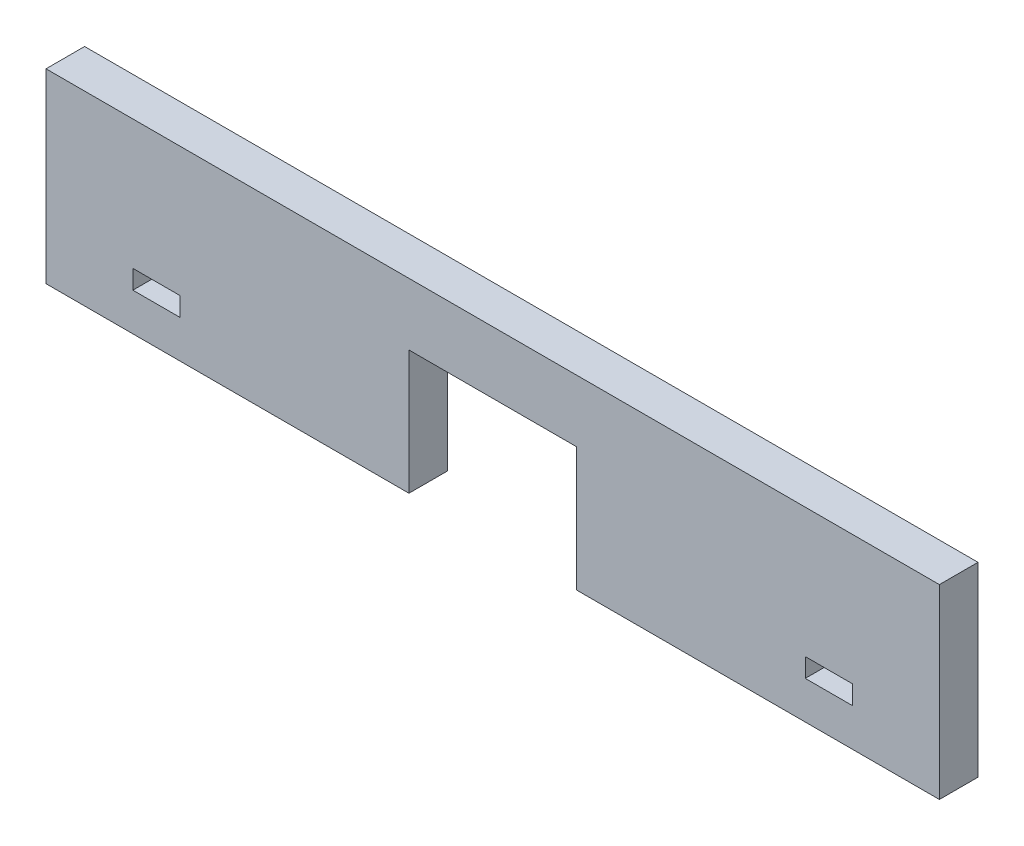
ISO-10303-21;
HEADER;
FILE_DESCRIPTION(('STEP AP214'),'2;1');
FILE_NAME('part.step','',(''),(''),'','','');
FILE_SCHEMA(('AUTOMOTIVE_DESIGN { 1 0 10303 214 1 1 1 1 }'));
ENDSEC;
DATA;
#1=APPLICATION_CONTEXT('core data for automotive mechanical design processes');
#2=APPLICATION_PROTOCOL_DEFINITION('international standard','automotive_design',2000,#1);
#3=PRODUCT_CONTEXT('',#1,'mechanical');
#4=PRODUCT('Part','Part','',(#3));
#5=PRODUCT_RELATED_PRODUCT_CATEGORY('part','',(#4));
#6=PRODUCT_DEFINITION_FORMATION('','',#4);
#7=PRODUCT_DEFINITION_CONTEXT('part definition',#1,'design');
#8=PRODUCT_DEFINITION('design','',#6,#7);
#9=PRODUCT_DEFINITION_SHAPE('','',#8);
#10=(LENGTH_UNIT() NAMED_UNIT(*) SI_UNIT(.MILLI.,.METRE.));
#11=(NAMED_UNIT(*) PLANE_ANGLE_UNIT() SI_UNIT($,.RADIAN.));
#12=(NAMED_UNIT(*) SI_UNIT($,.STERADIAN.) SOLID_ANGLE_UNIT());
#13=UNCERTAINTY_MEASURE_WITH_UNIT(LENGTH_MEASURE(1.E-05),#10,'distance_accuracy_value','');
#14=(GEOMETRIC_REPRESENTATION_CONTEXT(3) GLOBAL_UNCERTAINTY_ASSIGNED_CONTEXT((#13)) GLOBAL_UNIT_ASSIGNED_CONTEXT((#10,
#11,#12)) REPRESENTATION_CONTEXT('',''));
#15=CARTESIAN_POINT('',(0.,0.,0.));
#16=DIRECTION('',(0.,0.,1.));
#17=DIRECTION('',(1.,0.,0.));
#18=AXIS2_PLACEMENT_3D('',#15,#16,#17);
#19=CARTESIAN_POINT('',(0.,0.,3.1115));
#20=DIRECTION('',(0.,0.,-1.));
#21=DIRECTION('',(-1.,0.,0.));
#22=AXIS2_PLACEMENT_3D('',#19,#20,#21);
#23=PLANE('',#22);
#24=DIRECTION('',(0.,1.,0.));
#25=VECTOR('',#24,1.);
#26=CARTESIAN_POINT('',(-25.2074197182899,-4.5434357073753,3.1115));
#27=LINE('',#26,#25);
#28=CARTESIAN_POINT('',(-25.2074197182899,-4.5434357073753,3.1115));
#29=VERTEX_POINT('',#28);
#30=CARTESIAN_POINT('',(-25.2074197182899,-3.01943570737531,3.1115));
#31=VERTEX_POINT('',#30);
#32=EDGE_CURVE('E182',#29,#31,#27,.T.);
#33=ORIENTED_EDGE('',*,*,#32,.F.);
#34=DIRECTION('',(1.,0.,0.));
#35=VECTOR('',#34,1.);
#36=CARTESIAN_POINT('',(-29.0174197182899,-4.5434357073753,3.1115));
#37=LINE('',#36,#35);
#38=CARTESIAN_POINT('',(-29.0174197182899,-4.5434357073753,3.1115));
#39=VERTEX_POINT('',#38);
#40=EDGE_CURVE('E190',#39,#29,#37,.T.);
#41=ORIENTED_EDGE('',*,*,#40,.F.);
#42=DIRECTION('',(0.,-1.,0.));
#43=VECTOR('',#42,1.);
#44=CARTESIAN_POINT('',(-29.0174197182899,-4.5434357073753,3.1115));
#45=LINE('',#44,#43);
#46=CARTESIAN_POINT('',(-29.0174197182899,-3.01943570737531,3.1115));
#47=VERTEX_POINT('',#46);
#48=EDGE_CURVE('E187',#47,#39,#45,.T.);
#49=ORIENTED_EDGE('',*,*,#48,.F.);
#50=DIRECTION('',(-1.,0.,0.));
#51=VECTOR('',#50,1.);
#52=CARTESIAN_POINT('',(-29.0174197182899,-3.01943570737531,3.1115));
#53=LINE('',#52,#51);
#54=EDGE_CURVE('E184',#31,#47,#53,.T.);
#55=ORIENTED_EDGE('',*,*,#54,.F.);
#56=EDGE_LOOP('',(#33,#41,#49,#55));
#57=FACE_BOUND('',#56,.T.);
#58=DIRECTION('',(0.,1.,0.));
#59=VECTOR('',#58,1.);
#60=CARTESIAN_POINT('',(35.9825802817101,4.9085642926247,3.1115));
#61=LINE('',#60,#59);
#62=CARTESIAN_POINT('',(35.9825802817101,-7.5914357073753,3.1115));
#63=VERTEX_POINT('',#62);
#64=CARTESIAN_POINT('',(35.9825802817101,7.40856429262469,3.1115));
#65=VERTEX_POINT('',#64);
#66=EDGE_CURVE('E213',#63,#65,#61,.T.);
#67=ORIENTED_EDGE('',*,*,#66,.T.);
#68=DIRECTION('',(-1.,0.,0.));
#69=VECTOR('',#68,1.);
#70=CARTESIAN_POINT('',(-36.0174197182899,7.40856429262469,3.1115));
#71=LINE('',#70,#69);
#72=CARTESIAN_POINT('',(-36.0174197182899,7.40856429262469,3.1115));
#73=VERTEX_POINT('',#72);
#74=EDGE_CURVE('E216',#65,#73,#71,.T.);
#75=ORIENTED_EDGE('',*,*,#74,.T.);
#76=DIRECTION('',(0.,-1.,0.));
#77=VECTOR('',#76,1.);
#78=CARTESIAN_POINT('',(-36.0174197182899,4.9085642926247,3.1115));
#79=LINE('',#78,#77);
#80=CARTESIAN_POINT('',(-36.0174197182899,-7.5914357073753,3.1115));
#81=VERTEX_POINT('',#80);
#82=EDGE_CURVE('E219',#73,#81,#79,.T.);
#83=ORIENTED_EDGE('',*,*,#82,.T.);
#84=DIRECTION('',(1.,0.,0.));
#85=VECTOR('',#84,1.);
#86=CARTESIAN_POINT('',(-36.0174197182899,-7.5914357073753,3.1115));
#87=LINE('',#86,#85);
#88=CARTESIAN_POINT('',(-6.7674197182899,-7.5914357073753,3.1115));
#89=VERTEX_POINT('',#88);
#90=EDGE_CURVE('E221',#81,#89,#87,.T.);
#91=ORIENTED_EDGE('',*,*,#90,.T.);
#92=DIRECTION('',(0.,1.,0.));
#93=VECTOR('',#92,1.);
#94=CARTESIAN_POINT('',(-6.7674197182899,2.4085642926247,3.1115));
#95=LINE('',#94,#93);
#96=CARTESIAN_POINT('',(-6.7674197182899,2.4085642926247,3.1115));
#97=VERTEX_POINT('',#96);
#98=EDGE_CURVE('E223',#89,#97,#95,.T.);
#99=ORIENTED_EDGE('',*,*,#98,.T.);
#100=DIRECTION('',(1.,0.,0.));
#101=VECTOR('',#100,1.);
#102=CARTESIAN_POINT('',(-6.7674197182899,2.4085642926247,3.1115));
#103=LINE('',#102,#101);
#104=CARTESIAN_POINT('',(6.73258028171012,2.4085642926247,3.1115));
#105=VERTEX_POINT('',#104);
#106=EDGE_CURVE('E225',#97,#105,#103,.T.);
#107=ORIENTED_EDGE('',*,*,#106,.T.);
#108=DIRECTION('',(0.,-1.,0.));
#109=VECTOR('',#108,1.);
#110=CARTESIAN_POINT('',(6.73258028171012,2.4085642926247,3.1115));
#111=LINE('',#110,#109);
#112=CARTESIAN_POINT('',(6.73258028171012,-7.5914357073753,3.1115));
#113=VERTEX_POINT('',#112);
#114=EDGE_CURVE('E227',#105,#113,#111,.T.);
#115=ORIENTED_EDGE('',*,*,#114,.T.);
#116=DIRECTION('',(1.,0.,0.));
#117=VECTOR('',#116,1.);
#118=CARTESIAN_POINT('',(6.73258028171012,-7.5914357073753,3.1115));
#119=LINE('',#118,#117);
#120=EDGE_CURVE('E229',#113,#63,#119,.T.);
#121=ORIENTED_EDGE('',*,*,#120,.T.);
#122=EDGE_LOOP('',(#67,#75,#83,#91,#99,#107,#115,#121));
#123=FACE_BOUND('',#122,.T.);
#124=DIRECTION('',(1.,0.,0.));
#125=VECTOR('',#124,1.);
#126=CARTESIAN_POINT('',(28.9825802817101,-4.5434357073753,3.1115));
#127=LINE('',#126,#125);
#128=CARTESIAN_POINT('',(25.1725802817101,-4.5434357073753,3.1115));
#129=VERTEX_POINT('',#128);
#130=CARTESIAN_POINT('',(28.9825802817101,-4.5434357073753,3.1115));
#131=VERTEX_POINT('',#130);
#132=EDGE_CURVE('E146',#129,#131,#127,.T.);
#133=ORIENTED_EDGE('',*,*,#132,.F.);
#134=DIRECTION('',(0.,-1.,0.));
#135=VECTOR('',#134,1.);
#136=CARTESIAN_POINT('',(25.1725802817101,-4.5434357073753,3.1115));
#137=LINE('',#136,#135);
#138=CARTESIAN_POINT('',(25.1725802817101,-3.01943570737531,3.1115));
#139=VERTEX_POINT('',#138);
#140=EDGE_CURVE('E168',#139,#129,#137,.T.);
#141=ORIENTED_EDGE('',*,*,#140,.F.);
#142=DIRECTION('',(-1.,0.,0.));
#143=VECTOR('',#142,1.);
#144=CARTESIAN_POINT('',(28.9825802817101,-3.01943570737531,3.1115));
#145=LINE('',#144,#143);
#146=CARTESIAN_POINT('',(28.9825802817101,-3.01943570737531,3.1115));
#147=VERTEX_POINT('',#146);
#148=EDGE_CURVE('E166',#147,#139,#145,.T.);
#149=ORIENTED_EDGE('',*,*,#148,.F.);
#150=DIRECTION('',(0.,1.,0.));
#151=VECTOR('',#150,1.);
#152=CARTESIAN_POINT('',(28.9825802817101,-4.5434357073753,3.1115));
#153=LINE('',#152,#151);
#154=EDGE_CURVE('E154',#131,#147,#153,.T.);
#155=ORIENTED_EDGE('',*,*,#154,.F.);
#156=EDGE_LOOP('',(#133,#141,#149,#155));
#157=FACE_BOUND('',#156,.T.);
#158=ADVANCED_FACE('F33',(#57,#123,#157),#23,.F.);
#159=CARTESIAN_POINT('',(0.,0.,0.));
#160=DIRECTION('',(0.,0.,-1.));
#161=DIRECTION('',(-1.,0.,0.));
#162=AXIS2_PLACEMENT_3D('',#159,#160,#161);
#163=PLANE('',#162);
#164=DIRECTION('',(1.,0.,0.));
#165=VECTOR('',#164,1.);
#166=CARTESIAN_POINT('',(-29.0174197182899,-4.5434357073753,0.));
#167=LINE('',#166,#165);
#168=CARTESIAN_POINT('',(-29.0174197182899,-4.5434357073753,0.));
#169=VERTEX_POINT('',#168);
#170=CARTESIAN_POINT('',(-25.2074197182899,-4.5434357073753,0.));
#171=VERTEX_POINT('',#170);
#172=EDGE_CURVE('E185',#169,#171,#167,.T.);
#173=ORIENTED_EDGE('',*,*,#172,.T.);
#174=DIRECTION('',(0.,1.,0.));
#175=VECTOR('',#174,1.);
#176=CARTESIAN_POINT('',(-25.2074197182899,-4.5434357073753,0.));
#177=LINE('',#176,#175);
#178=CARTESIAN_POINT('',(-25.2074197182899,-3.01943570737531,0.));
#179=VERTEX_POINT('',#178);
#180=EDGE_CURVE('E162',#171,#179,#177,.T.);
#181=ORIENTED_EDGE('',*,*,#180,.T.);
#182=DIRECTION('',(-1.,0.,0.));
#183=VECTOR('',#182,1.);
#184=CARTESIAN_POINT('',(-29.0174197182899,-3.01943570737531,0.));
#185=LINE('',#184,#183);
#186=CARTESIAN_POINT('',(-29.0174197182899,-3.01943570737531,0.));
#187=VERTEX_POINT('',#186);
#188=EDGE_CURVE('E195',#179,#187,#185,.T.);
#189=ORIENTED_EDGE('',*,*,#188,.T.);
#190=DIRECTION('',(0.,-1.,0.));
#191=VECTOR('',#190,1.);
#192=CARTESIAN_POINT('',(-29.0174197182899,-4.5434357073753,0.));
#193=LINE('',#192,#191);
#194=EDGE_CURVE('E198',#187,#169,#193,.T.);
#195=ORIENTED_EDGE('',*,*,#194,.T.);
#196=EDGE_LOOP('',(#173,#181,#189,#195));
#197=FACE_BOUND('',#196,.T.);
#198=DIRECTION('',(-1.,0.,0.));
#199=VECTOR('',#198,1.);
#200=CARTESIAN_POINT('',(-36.0174197182899,7.40856429262469,0.));
#201=LINE('',#200,#199);
#202=CARTESIAN_POINT('',(35.9825802817101,7.40856429262469,0.));
#203=VERTEX_POINT('',#202);
#204=CARTESIAN_POINT('',(-36.0174197182899,7.40856429262469,0.));
#205=VERTEX_POINT('',#204);
#206=EDGE_CURVE('E212',#203,#205,#201,.T.);
#207=ORIENTED_EDGE('',*,*,#206,.F.);
#208=DIRECTION('',(0.,1.,0.));
#209=VECTOR('',#208,1.);
#210=CARTESIAN_POINT('',(35.9825802817101,4.9085642926247,0.));
#211=LINE('',#210,#209);
#212=CARTESIAN_POINT('',(35.9825802817101,-7.5914357073753,0.));
#213=VERTEX_POINT('',#212);
#214=EDGE_CURVE('E217',#213,#203,#211,.T.);
#215=ORIENTED_EDGE('',*,*,#214,.F.);
#216=DIRECTION('',(1.,0.,0.));
#217=VECTOR('',#216,1.);
#218=CARTESIAN_POINT('',(6.73258028171012,-7.5914357073753,0.));
#219=LINE('',#218,#217);
#220=CARTESIAN_POINT('',(6.73258028171012,-7.5914357073753,0.));
#221=VERTEX_POINT('',#220);
#222=EDGE_CURVE('E245',#221,#213,#219,.T.);
#223=ORIENTED_EDGE('',*,*,#222,.F.);
#224=DIRECTION('',(0.,-1.,0.));
#225=VECTOR('',#224,1.);
#226=CARTESIAN_POINT('',(6.73258028171012,2.4085642926247,0.));
#227=LINE('',#226,#225);
#228=CARTESIAN_POINT('',(6.73258028171012,2.4085642926247,0.));
#229=VERTEX_POINT('',#228);
#230=EDGE_CURVE('E243',#229,#221,#227,.T.);
#231=ORIENTED_EDGE('',*,*,#230,.F.);
#232=DIRECTION('',(1.,0.,0.));
#233=VECTOR('',#232,1.);
#234=CARTESIAN_POINT('',(-6.7674197182899,2.4085642926247,0.));
#235=LINE('',#234,#233);
#236=CARTESIAN_POINT('',(-6.7674197182899,2.4085642926247,0.));
#237=VERTEX_POINT('',#236);
#238=EDGE_CURVE('E241',#237,#229,#235,.T.);
#239=ORIENTED_EDGE('',*,*,#238,.F.);
#240=DIRECTION('',(0.,1.,0.));
#241=VECTOR('',#240,1.);
#242=CARTESIAN_POINT('',(-6.7674197182899,2.4085642926247,0.));
#243=LINE('',#242,#241);
#244=CARTESIAN_POINT('',(-6.7674197182899,-7.5914357073753,0.));
#245=VERTEX_POINT('',#244);
#246=EDGE_CURVE('E239',#245,#237,#243,.T.);
#247=ORIENTED_EDGE('',*,*,#246,.F.);
#248=DIRECTION('',(1.,0.,0.));
#249=VECTOR('',#248,1.);
#250=CARTESIAN_POINT('',(-36.0174197182899,-7.5914357073753,0.));
#251=LINE('',#250,#249);
#252=CARTESIAN_POINT('',(-36.0174197182899,-7.5914357073753,0.));
#253=VERTEX_POINT('',#252);
#254=EDGE_CURVE('E237',#253,#245,#251,.T.);
#255=ORIENTED_EDGE('',*,*,#254,.F.);
#256=DIRECTION('',(0.,-1.,0.));
#257=VECTOR('',#256,1.);
#258=CARTESIAN_POINT('',(-36.0174197182899,-7.5914357073753,0.));
#259=LINE('',#258,#257);
#260=EDGE_CURVE('E235',#205,#253,#259,.T.);
#261=ORIENTED_EDGE('',*,*,#260,.F.);
#262=EDGE_LOOP('',(#207,#215,#223,#231,#239,#247,#255,#261));
#263=FACE_BOUND('',#262,.T.);
#264=DIRECTION('',(0.,-1.,0.));
#265=VECTOR('',#264,1.);
#266=CARTESIAN_POINT('',(25.1725802817101,-4.5434357073753,0.));
#267=LINE('',#266,#265);
#268=CARTESIAN_POINT('',(25.1725802817101,-3.01943570737531,0.));
#269=VERTEX_POINT('',#268);
#270=CARTESIAN_POINT('',(25.1725802817101,-4.5434357073753,0.));
#271=VERTEX_POINT('',#270);
#272=EDGE_CURVE('E155',#269,#271,#267,.T.);
#273=ORIENTED_EDGE('',*,*,#272,.T.);
#274=DIRECTION('',(1.,0.,0.));
#275=VECTOR('',#274,1.);
#276=CARTESIAN_POINT('',(28.9825802817101,-4.5434357073753,0.));
#277=LINE('',#276,#275);
#278=CARTESIAN_POINT('',(28.9825802817101,-4.5434357073753,0.));
#279=VERTEX_POINT('',#278);
#280=EDGE_CURVE('E56',#271,#279,#277,.T.);
#281=ORIENTED_EDGE('',*,*,#280,.T.);
#282=DIRECTION('',(0.,1.,0.));
#283=VECTOR('',#282,1.);
#284=CARTESIAN_POINT('',(28.9825802817101,-4.5434357073753,0.));
#285=LINE('',#284,#283);
#286=CARTESIAN_POINT('',(28.9825802817101,-3.01943570737531,0.));
#287=VERTEX_POINT('',#286);
#288=EDGE_CURVE('E161',#279,#287,#285,.T.);
#289=ORIENTED_EDGE('',*,*,#288,.T.);
#290=DIRECTION('',(-1.,0.,0.));
#291=VECTOR('',#290,1.);
#292=CARTESIAN_POINT('',(28.9825802817101,-3.01943570737531,0.));
#293=LINE('',#292,#291);
#294=EDGE_CURVE('E174',#287,#269,#293,.T.);
#295=ORIENTED_EDGE('',*,*,#294,.T.);
#296=EDGE_LOOP('',(#273,#281,#289,#295));
#297=FACE_BOUND('',#296,.T.);
#298=ADVANCED_FACE('F275',(#197,#263,#297),#163,.T.);
#299=CARTESIAN_POINT('',(-36.0174197182899,7.40856429262469,3.1115));
#300=DIRECTION('',(0.,-1.,0.));
#301=DIRECTION('',(0.,0.,-1.));
#302=AXIS2_PLACEMENT_3D('',#299,#300,#301);
#303=PLANE('',#302);
#304=ORIENTED_EDGE('',*,*,#206,.T.);
#305=DIRECTION('',(0.,0.,-1.));
#306=VECTOR('',#305,1.);
#307=CARTESIAN_POINT('',(-36.0174197182899,7.40856429262469,3.1115));
#308=LINE('',#307,#306);
#309=EDGE_CURVE('E41',#73,#205,#308,.T.);
#310=ORIENTED_EDGE('',*,*,#309,.F.);
#311=ORIENTED_EDGE('',*,*,#74,.F.);
#312=DIRECTION('',(0.,0.,-1.));
#313=VECTOR('',#312,1.);
#314=CARTESIAN_POINT('',(35.9825802817101,7.40856429262469,3.1115));
#315=LINE('',#314,#313);
#316=EDGE_CURVE('E11',#65,#203,#315,.T.);
#317=ORIENTED_EDGE('',*,*,#316,.T.);
#318=EDGE_LOOP('',(#304,#310,#311,#317));
#319=FACE_BOUND('',#318,.T.);
#320=ADVANCED_FACE('F35',(#319),#303,.F.);
#321=CARTESIAN_POINT('',(-36.0174197182899,-7.5914357073753,3.1115));
#322=DIRECTION('',(1.,0.,0.));
#323=DIRECTION('',(0.,0.,-1.));
#324=AXIS2_PLACEMENT_3D('',#321,#322,#323);
#325=PLANE('',#324);
#326=ORIENTED_EDGE('',*,*,#260,.T.);
#327=DIRECTION('',(0.,0.,-1.));
#328=VECTOR('',#327,1.);
#329=CARTESIAN_POINT('',(-36.0174197182899,-7.5914357073753,3.1115));
#330=LINE('',#329,#328);
#331=EDGE_CURVE('E263',#81,#253,#330,.T.);
#332=ORIENTED_EDGE('',*,*,#331,.F.);
#333=ORIENTED_EDGE('',*,*,#82,.F.);
#334=ORIENTED_EDGE('',*,*,#309,.T.);
#335=EDGE_LOOP('',(#326,#332,#333,#334));
#336=FACE_BOUND('',#335,.T.);
#337=ADVANCED_FACE('F269',(#336),#325,.F.);
#338=CARTESIAN_POINT('',(-36.0174197182899,-7.5914357073753,3.1115));
#339=DIRECTION('',(0.,1.,0.));
#340=DIRECTION('',(0.,0.,1.));
#341=AXIS2_PLACEMENT_3D('',#338,#339,#340);
#342=PLANE('',#341);
#343=ORIENTED_EDGE('',*,*,#254,.T.);
#344=DIRECTION('',(0.,0.,-1.));
#345=VECTOR('',#344,1.);
#346=CARTESIAN_POINT('',(-6.7674197182899,-7.5914357073753,3.1115));
#347=LINE('',#346,#345);
#348=EDGE_CURVE('E260',#89,#245,#347,.T.);
#349=ORIENTED_EDGE('',*,*,#348,.F.);
#350=ORIENTED_EDGE('',*,*,#90,.F.);
#351=ORIENTED_EDGE('',*,*,#331,.T.);
#352=EDGE_LOOP('',(#343,#349,#350,#351));
#353=FACE_BOUND('',#352,.T.);
#354=ADVANCED_FACE('F283',(#353),#342,.F.);
#355=CARTESIAN_POINT('',(-6.7674197182899,2.4085642926247,3.1115));
#356=DIRECTION('',(-1.,0.,0.));
#357=DIRECTION('',(0.,0.,1.));
#358=AXIS2_PLACEMENT_3D('',#355,#356,#357);
#359=PLANE('',#358);
#360=ORIENTED_EDGE('',*,*,#246,.T.);
#361=DIRECTION('',(0.,0.,-1.));
#362=VECTOR('',#361,1.);
#363=CARTESIAN_POINT('',(-6.7674197182899,2.4085642926247,3.1115));
#364=LINE('',#363,#362);
#365=EDGE_CURVE('E257',#97,#237,#364,.T.);
#366=ORIENTED_EDGE('',*,*,#365,.F.);
#367=ORIENTED_EDGE('',*,*,#98,.F.);
#368=ORIENTED_EDGE('',*,*,#348,.T.);
#369=EDGE_LOOP('',(#360,#366,#367,#368));
#370=FACE_BOUND('',#369,.T.);
#371=ADVANCED_FACE('F287',(#370),#359,.F.);
#372=CARTESIAN_POINT('',(-6.7674197182899,2.4085642926247,3.1115));
#373=DIRECTION('',(0.,1.,0.));
#374=DIRECTION('',(0.,0.,1.));
#375=AXIS2_PLACEMENT_3D('',#372,#373,#374);
#376=PLANE('',#375);
#377=ORIENTED_EDGE('',*,*,#238,.T.);
#378=DIRECTION('',(0.,0.,-1.));
#379=VECTOR('',#378,1.);
#380=CARTESIAN_POINT('',(6.73258028171012,2.4085642926247,3.1115));
#381=LINE('',#380,#379);
#382=EDGE_CURVE('E254',#105,#229,#381,.T.);
#383=ORIENTED_EDGE('',*,*,#382,.F.);
#384=ORIENTED_EDGE('',*,*,#106,.F.);
#385=ORIENTED_EDGE('',*,*,#365,.T.);
#386=EDGE_LOOP('',(#377,#383,#384,#385));
#387=FACE_BOUND('',#386,.T.);
#388=ADVANCED_FACE('F304',(#387),#376,.F.);
#389=CARTESIAN_POINT('',(6.73258028171012,2.4085642926247,3.1115));
#390=DIRECTION('',(1.,0.,0.));
#391=DIRECTION('',(0.,0.,-1.));
#392=AXIS2_PLACEMENT_3D('',#389,#390,#391);
#393=PLANE('',#392);
#394=ORIENTED_EDGE('',*,*,#230,.T.);
#395=DIRECTION('',(0.,0.,-1.));
#396=VECTOR('',#395,1.);
#397=CARTESIAN_POINT('',(6.73258028171012,-7.5914357073753,3.1115));
#398=LINE('',#397,#396);
#399=EDGE_CURVE('E251',#113,#221,#398,.T.);
#400=ORIENTED_EDGE('',*,*,#399,.F.);
#401=ORIENTED_EDGE('',*,*,#114,.F.);
#402=ORIENTED_EDGE('',*,*,#382,.T.);
#403=EDGE_LOOP('',(#394,#400,#401,#402));
#404=FACE_BOUND('',#403,.T.);
#405=ADVANCED_FACE('F301',(#404),#393,.F.);
#406=CARTESIAN_POINT('',(6.73258028171012,-7.5914357073753,3.1115));
#407=DIRECTION('',(0.,1.,0.));
#408=DIRECTION('',(0.,0.,1.));
#409=AXIS2_PLACEMENT_3D('',#406,#407,#408);
#410=PLANE('',#409);
#411=ORIENTED_EDGE('',*,*,#222,.T.);
#412=DIRECTION('',(0.,0.,-1.));
#413=VECTOR('',#412,1.);
#414=CARTESIAN_POINT('',(35.9825802817101,-7.5914357073753,3.1115));
#415=LINE('',#414,#413);
#416=EDGE_CURVE('E232',#63,#213,#415,.T.);
#417=ORIENTED_EDGE('',*,*,#416,.F.);
#418=ORIENTED_EDGE('',*,*,#120,.F.);
#419=ORIENTED_EDGE('',*,*,#399,.T.);
#420=EDGE_LOOP('',(#411,#417,#418,#419));
#421=FACE_BOUND('',#420,.T.);
#422=ADVANCED_FACE('F297',(#421),#410,.F.);
#423=CARTESIAN_POINT('',(35.9825802817101,4.9085642926247,3.1115));
#424=DIRECTION('',(-1.,0.,0.));
#425=DIRECTION('',(0.,0.,1.));
#426=AXIS2_PLACEMENT_3D('',#423,#424,#425);
#427=PLANE('',#426);
#428=ORIENTED_EDGE('',*,*,#214,.T.);
#429=ORIENTED_EDGE('',*,*,#316,.F.);
#430=ORIENTED_EDGE('',*,*,#66,.F.);
#431=ORIENTED_EDGE('',*,*,#416,.T.);
#432=EDGE_LOOP('',(#428,#429,#430,#431));
#433=FACE_BOUND('',#432,.T.);
#434=ADVANCED_FACE('F295',(#433),#427,.F.);
#435=CARTESIAN_POINT('',(-25.2074197182899,-4.5434357073753,3.1115));
#436=DIRECTION('',(-1.,0.,0.));
#437=DIRECTION('',(0.,0.,1.));
#438=AXIS2_PLACEMENT_3D('',#435,#436,#437);
#439=PLANE('',#438);
#440=ORIENTED_EDGE('',*,*,#180,.F.);
#441=DIRECTION('',(0.,0.,-1.));
#442=VECTOR('',#441,1.);
#443=CARTESIAN_POINT('',(-25.2074197182899,-4.5434357073753,3.1115));
#444=LINE('',#443,#442);
#445=EDGE_CURVE('E192',#29,#171,#444,.T.);
#446=ORIENTED_EDGE('',*,*,#445,.F.);
#447=ORIENTED_EDGE('',*,*,#32,.T.);
#448=DIRECTION('',(0.,0.,-1.));
#449=VECTOR('',#448,1.);
#450=CARTESIAN_POINT('',(-25.2074197182899,-3.01943570737531,3.1115));
#451=LINE('',#450,#449);
#452=EDGE_CURVE('E209',#31,#179,#451,.T.);
#453=ORIENTED_EDGE('',*,*,#452,.T.);
#454=EDGE_LOOP('',(#440,#446,#447,#453));
#455=FACE_BOUND('',#454,.T.);
#456=ADVANCED_FACE('F323',(#455),#439,.T.);
#457=CARTESIAN_POINT('',(-29.0174197182899,-3.01943570737531,3.1115));
#458=DIRECTION('',(0.,-1.,0.));
#459=DIRECTION('',(0.,0.,-1.));
#460=AXIS2_PLACEMENT_3D('',#457,#458,#459);
#461=PLANE('',#460);
#462=ORIENTED_EDGE('',*,*,#188,.F.);
#463=ORIENTED_EDGE('',*,*,#452,.F.);
#464=ORIENTED_EDGE('',*,*,#54,.T.);
#465=DIRECTION('',(0.,0.,-1.));
#466=VECTOR('',#465,1.);
#467=CARTESIAN_POINT('',(-29.0174197182899,-3.01943570737531,3.1115));
#468=LINE('',#467,#466);
#469=EDGE_CURVE('E207',#47,#187,#468,.T.);
#470=ORIENTED_EDGE('',*,*,#469,.T.);
#471=EDGE_LOOP('',(#462,#463,#464,#470));
#472=FACE_BOUND('',#471,.T.);
#473=ADVANCED_FACE('F343',(#472),#461,.T.);
#474=CARTESIAN_POINT('',(-29.0174197182899,-4.5434357073753,3.1115));
#475=DIRECTION('',(1.,0.,0.));
#476=DIRECTION('',(0.,0.,-1.));
#477=AXIS2_PLACEMENT_3D('',#474,#475,#476);
#478=PLANE('',#477);
#479=ORIENTED_EDGE('',*,*,#194,.F.);
#480=ORIENTED_EDGE('',*,*,#469,.F.);
#481=ORIENTED_EDGE('',*,*,#48,.T.);
#482=DIRECTION('',(0.,0.,-1.));
#483=VECTOR('',#482,1.);
#484=CARTESIAN_POINT('',(-29.0174197182899,-4.5434357073753,3.1115));
#485=LINE('',#484,#483);
#486=EDGE_CURVE('E205',#39,#169,#485,.T.);
#487=ORIENTED_EDGE('',*,*,#486,.T.);
#488=EDGE_LOOP('',(#479,#480,#481,#487));
#489=FACE_BOUND('',#488,.T.);
#490=ADVANCED_FACE('F350',(#489),#478,.T.);
#491=CARTESIAN_POINT('',(-29.0174197182899,-4.5434357073753,3.1115));
#492=DIRECTION('',(0.,1.,0.));
#493=DIRECTION('',(0.,0.,1.));
#494=AXIS2_PLACEMENT_3D('',#491,#492,#493);
#495=PLANE('',#494);
#496=ORIENTED_EDGE('',*,*,#172,.F.);
#497=ORIENTED_EDGE('',*,*,#486,.F.);
#498=ORIENTED_EDGE('',*,*,#40,.T.);
#499=ORIENTED_EDGE('',*,*,#445,.T.);
#500=EDGE_LOOP('',(#496,#497,#498,#499));
#501=FACE_BOUND('',#500,.T.);
#502=ADVANCED_FACE('F357',(#501),#495,.T.);
#503=CARTESIAN_POINT('',(28.9825802817101,-4.5434357073753,3.1115));
#504=DIRECTION('',(0.,1.,0.));
#505=DIRECTION('',(0.,0.,1.));
#506=AXIS2_PLACEMENT_3D('',#503,#504,#505);
#507=PLANE('',#506);
#508=ORIENTED_EDGE('',*,*,#280,.F.);
#509=DIRECTION('',(0.,0.,-1.));
#510=VECTOR('',#509,1.);
#511=CARTESIAN_POINT('',(25.1725802817101,-4.5434357073753,3.1115));
#512=LINE('',#511,#510);
#513=EDGE_CURVE('E150',#129,#271,#512,.T.);
#514=ORIENTED_EDGE('',*,*,#513,.F.);
#515=ORIENTED_EDGE('',*,*,#132,.T.);
#516=DIRECTION('',(0.,0.,-1.));
#517=VECTOR('',#516,1.);
#518=CARTESIAN_POINT('',(28.9825802817101,-4.5434357073753,3.1115));
#519=LINE('',#518,#517);
#520=EDGE_CURVE('E149',#131,#279,#519,.T.);
#521=ORIENTED_EDGE('',*,*,#520,.T.);
#522=EDGE_LOOP('',(#508,#514,#515,#521));
#523=FACE_BOUND('',#522,.T.);
#524=ADVANCED_FACE('F148',(#523),#507,.T.);
#525=CARTESIAN_POINT('',(28.9825802817101,-4.5434357073753,3.1115));
#526=DIRECTION('',(-1.,0.,0.));
#527=DIRECTION('',(0.,0.,1.));
#528=AXIS2_PLACEMENT_3D('',#525,#526,#527);
#529=PLANE('',#528);
#530=ORIENTED_EDGE('',*,*,#288,.F.);
#531=ORIENTED_EDGE('',*,*,#520,.F.);
#532=ORIENTED_EDGE('',*,*,#154,.T.);
#533=DIRECTION('',(0.,0.,-1.));
#534=VECTOR('',#533,1.);
#535=CARTESIAN_POINT('',(28.9825802817101,-3.01943570737531,3.1115));
#536=LINE('',#535,#534);
#537=EDGE_CURVE('E163',#147,#287,#536,.T.);
#538=ORIENTED_EDGE('',*,*,#537,.T.);
#539=EDGE_LOOP('',(#530,#531,#532,#538));
#540=FACE_BOUND('',#539,.T.);
#541=ADVANCED_FACE('F158',(#540),#529,.T.);
#542=CARTESIAN_POINT('',(28.9825802817101,-3.01943570737531,3.1115));
#543=DIRECTION('',(0.,-1.,0.));
#544=DIRECTION('',(0.,0.,-1.));
#545=AXIS2_PLACEMENT_3D('',#542,#543,#544);
#546=PLANE('',#545);
#547=ORIENTED_EDGE('',*,*,#294,.F.);
#548=ORIENTED_EDGE('',*,*,#537,.F.);
#549=ORIENTED_EDGE('',*,*,#148,.T.);
#550=DIRECTION('',(0.,0.,-1.));
#551=VECTOR('',#550,1.);
#552=CARTESIAN_POINT('',(25.1725802817101,-3.01943570737531,3.1115));
#553=LINE('',#552,#551);
#554=EDGE_CURVE('E48',#139,#269,#553,.T.);
#555=ORIENTED_EDGE('',*,*,#554,.T.);
#556=EDGE_LOOP('',(#547,#548,#549,#555));
#557=FACE_BOUND('',#556,.T.);
#558=ADVANCED_FACE('F378',(#557),#546,.T.);
#559=CARTESIAN_POINT('',(25.1725802817101,-4.5434357073753,3.1115));
#560=DIRECTION('',(1.,0.,0.));
#561=DIRECTION('',(0.,0.,-1.));
#562=AXIS2_PLACEMENT_3D('',#559,#560,#561);
#563=PLANE('',#562);
#564=ORIENTED_EDGE('',*,*,#272,.F.);
#565=ORIENTED_EDGE('',*,*,#554,.F.);
#566=ORIENTED_EDGE('',*,*,#140,.T.);
#567=ORIENTED_EDGE('',*,*,#513,.T.);
#568=EDGE_LOOP('',(#564,#565,#566,#567));
#569=FACE_BOUND('',#568,.T.);
#570=ADVANCED_FACE('F385',(#569),#563,.T.);
#571=CLOSED_SHELL('',(#158,#298,#320,#337,#354,#371,#388,#405,#422,#434,#456,#473,#490,#502,
#524,#541,#558,#570));
#572=MANIFOLD_SOLID_BREP('B2',#571);
#573=ADVANCED_BREP_SHAPE_REPRESENTATION('',(#18,#572),#14);
#574=SHAPE_DEFINITION_REPRESENTATION(#9,#573);
ENDSEC;
END-ISO-10303-21;
